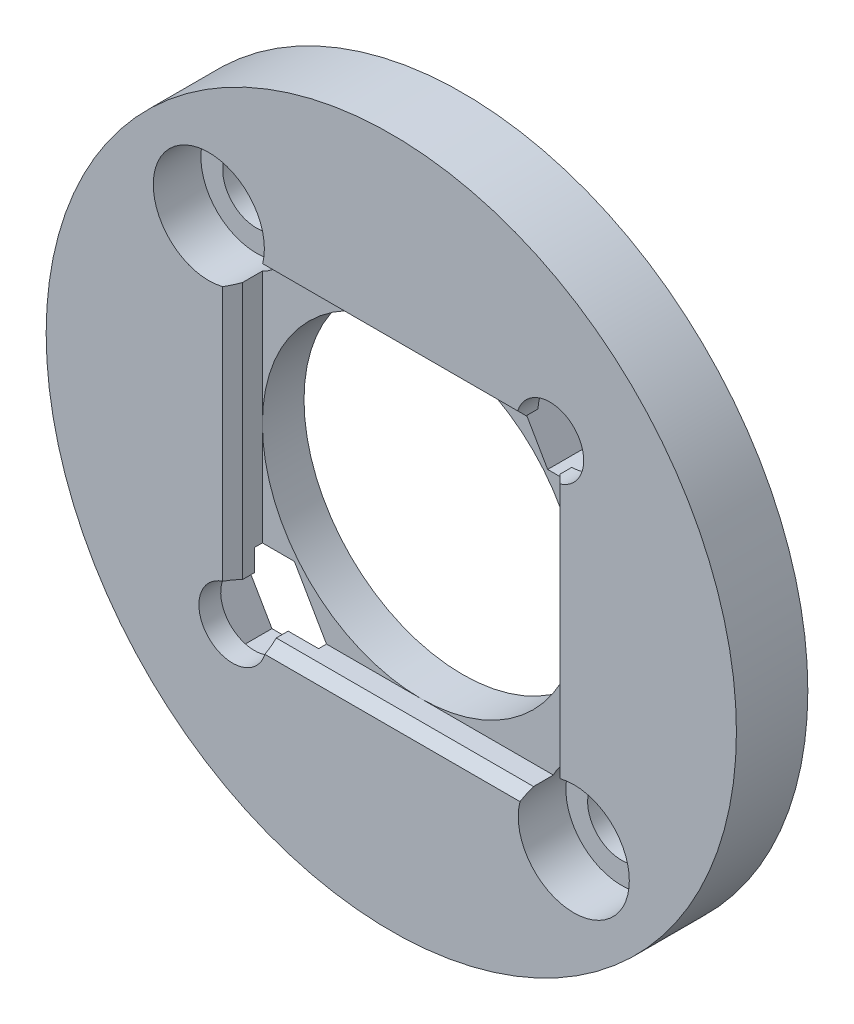
ISO-10303-21;
HEADER;
FILE_DESCRIPTION(('STEP AP214'),'2;1');
FILE_NAME('part.step','',(''),(''),'','','');
FILE_SCHEMA(('AUTOMOTIVE_DESIGN { 1 0 10303 214 1 1 1 1 }'));
ENDSEC;
DATA;
#1=APPLICATION_CONTEXT('core data for automotive mechanical design processes');
#2=APPLICATION_PROTOCOL_DEFINITION('international standard','automotive_design',2000,#1);
#3=PRODUCT_CONTEXT('',#1,'mechanical');
#4=PRODUCT('Part','Part','',(#3));
#5=PRODUCT_RELATED_PRODUCT_CATEGORY('part','',(#4));
#6=PRODUCT_DEFINITION_FORMATION('','',#4);
#7=PRODUCT_DEFINITION_CONTEXT('part definition',#1,'design');
#8=PRODUCT_DEFINITION('design','',#6,#7);
#9=PRODUCT_DEFINITION_SHAPE('','',#8);
#10=(LENGTH_UNIT() NAMED_UNIT(*) SI_UNIT(.MILLI.,.METRE.));
#11=(NAMED_UNIT(*) PLANE_ANGLE_UNIT() SI_UNIT($,.RADIAN.));
#12=(NAMED_UNIT(*) SI_UNIT($,.STERADIAN.) SOLID_ANGLE_UNIT());
#13=UNCERTAINTY_MEASURE_WITH_UNIT(LENGTH_MEASURE(1.E-05),#10,'distance_accuracy_value','');
#14=(GEOMETRIC_REPRESENTATION_CONTEXT(3) GLOBAL_UNCERTAINTY_ASSIGNED_CONTEXT((#13)) GLOBAL_UNIT_ASSIGNED_CONTEXT((#10,
#11,#12)) REPRESENTATION_CONTEXT('',''));
#15=CARTESIAN_POINT('',(0.,0.,0.));
#16=DIRECTION('',(0.,0.,1.));
#17=DIRECTION('',(1.,0.,0.));
#18=AXIS2_PLACEMENT_3D('',#15,#16,#17);
#19=CARTESIAN_POINT('',(8.,8.,0.));
#20=DIRECTION('',(0.,0.,1.));
#21=DIRECTION('',(1.,0.,0.));
#22=AXIS2_PLACEMENT_3D('',#19,#20,#21);
#23=CYLINDRICAL_SURFACE('',#22,1.7);
#24=DIRECTION('',(0.,0.,1.));
#25=VECTOR('',#24,1.);
#26=CARTESIAN_POINT('',(8.,6.3,0.));
#27=LINE('',#26,#25);
#28=CARTESIAN_POINT('',(8.,6.3,2.5));
#29=VERTEX_POINT('',#28);
#30=CARTESIAN_POINT('',(8.,6.3,3.10000000000001));
#31=VERTEX_POINT('',#30);
#32=EDGE_CURVE('E283',#29,#31,#27,.T.);
#33=ORIENTED_EDGE('',*,*,#32,.T.);
#34=CARTESIAN_POINT('',(8.,8.,3.10000000000001));
#35=DIRECTION('',(-0.707106781186543,0.,0.707106781186552));
#36=DIRECTION('',(0.707106781186552,0.,0.707106781186543));
#37=AXIS2_PLACEMENT_3D('',#34,#35,#36);
#38=ELLIPSE('',#37,2.40416305603424,1.7);
#39=CARTESIAN_POINT('',(8.5,6.37519231907281,3.6));
#40=VERTEX_POINT('',#39);
#41=EDGE_CURVE('E51',#31,#40,#38,.T.);
#42=ORIENTED_EDGE('',*,*,#41,.T.);
#43=CARTESIAN_POINT('',(8.,8.,3.6));
#44=DIRECTION('',(0.,0.,1.));
#45=DIRECTION('',(1.,0.,0.));
#46=AXIS2_PLACEMENT_3D('',#43,#44,#45);
#47=CIRCLE('',#46,1.7);
#48=CARTESIAN_POINT('',(6.3751923190728,8.5,3.6));
#49=VERTEX_POINT('',#48);
#50=EDGE_CURVE('E445',#40,#49,#47,.T.);
#51=ORIENTED_EDGE('',*,*,#50,.T.);
#52=CARTESIAN_POINT('',(8.,8.,3.10000000000001));
#53=DIRECTION('',(0.,-0.707106781186543,0.707106781186552));
#54=DIRECTION('',(0.,0.707106781186552,0.707106781186543));
#55=AXIS2_PLACEMENT_3D('',#52,#53,#54);
#56=ELLIPSE('',#55,2.40416305603424,1.7);
#57=CARTESIAN_POINT('',(6.3,8.,3.10000000000001));
#58=VERTEX_POINT('',#57);
#59=EDGE_CURVE('E58',#49,#58,#56,.T.);
#60=ORIENTED_EDGE('',*,*,#59,.T.);
#61=DIRECTION('',(0.,0.,1.));
#62=VECTOR('',#61,1.);
#63=CARTESIAN_POINT('',(6.3,8.,0.));
#64=LINE('',#63,#62);
#65=CARTESIAN_POINT('',(6.3,8.,2.5));
#66=VERTEX_POINT('',#65);
#67=EDGE_CURVE('E592',#58,#66,#64,.F.);
#68=ORIENTED_EDGE('',*,*,#67,.T.);
#69=CARTESIAN_POINT('',(8.,8.,2.5));
#70=DIRECTION('',(0.,0.,-1.));
#71=DIRECTION('',(-1.,0.,0.));
#72=AXIS2_PLACEMENT_3D('',#69,#70,#71);
#73=CIRCLE('',#72,1.7);
#74=EDGE_CURVE('E448',#29,#66,#73,.F.);
#75=ORIENTED_EDGE('',*,*,#74,.F.);
#76=EDGE_LOOP('',(#33,#42,#51,#60,#68,#75));
#77=FACE_BOUND('',#76,.T.);
#78=ADVANCED_FACE('F41',(#77),#23,.F.);
#79=CARTESIAN_POINT('',(-8.,-8.,0.));
#80=DIRECTION('',(0.,0.,1.));
#81=DIRECTION('',(1.,0.,0.));
#82=AXIS2_PLACEMENT_3D('',#79,#80,#81);
#83=CYLINDRICAL_SURFACE('',#82,1.7);
#84=DIRECTION('',(0.,0.,1.));
#85=VECTOR('',#84,1.);
#86=CARTESIAN_POINT('',(-8.,-6.3,0.));
#87=LINE('',#86,#85);
#88=CARTESIAN_POINT('',(-8.,-6.3,2.5));
#89=VERTEX_POINT('',#88);
#90=CARTESIAN_POINT('',(-8.,-6.3,3.10000000000001));
#91=VERTEX_POINT('',#90);
#92=EDGE_CURVE('E304',#89,#91,#87,.T.);
#93=ORIENTED_EDGE('',*,*,#92,.T.);
#94=CARTESIAN_POINT('',(-8.,-8.,3.10000000000001));
#95=DIRECTION('',(0.707106781186543,0.,0.707106781186552));
#96=DIRECTION('',(-0.707106781186552,0.,0.707106781186543));
#97=AXIS2_PLACEMENT_3D('',#94,#95,#96);
#98=ELLIPSE('',#97,2.40416305603425,1.7);
#99=CARTESIAN_POINT('',(-8.5,-6.37519231907281,3.6));
#100=VERTEX_POINT('',#99);
#101=EDGE_CURVE('E517',#91,#100,#98,.T.);
#102=ORIENTED_EDGE('',*,*,#101,.T.);
#103=CARTESIAN_POINT('',(-8.,-8.,3.6));
#104=DIRECTION('',(0.,0.,1.));
#105=DIRECTION('',(1.,0.,0.));
#106=AXIS2_PLACEMENT_3D('',#103,#104,#105);
#107=CIRCLE('',#106,1.7);
#108=CARTESIAN_POINT('',(-6.37519231907281,-8.5,3.6));
#109=VERTEX_POINT('',#108);
#110=EDGE_CURVE('E440',#100,#109,#107,.T.);
#111=ORIENTED_EDGE('',*,*,#110,.T.);
#112=CARTESIAN_POINT('',(-8.,-8.,3.10000000000001));
#113=DIRECTION('',(0.,0.707106781186543,0.707106781186552));
#114=DIRECTION('',(0.,-0.707106781186552,0.707106781186543));
#115=AXIS2_PLACEMENT_3D('',#112,#113,#114);
#116=ELLIPSE('',#115,2.40416305603425,1.7);
#117=CARTESIAN_POINT('',(-6.3,-8.,3.10000000000001));
#118=VERTEX_POINT('',#117);
#119=EDGE_CURVE('E514',#109,#118,#116,.T.);
#120=ORIENTED_EDGE('',*,*,#119,.T.);
#121=DIRECTION('',(0.,0.,1.));
#122=VECTOR('',#121,1.);
#123=CARTESIAN_POINT('',(-6.3,-8.,0.));
#124=LINE('',#123,#122);
#125=CARTESIAN_POINT('',(-6.3,-8.,2.5));
#126=VERTEX_POINT('',#125);
#127=EDGE_CURVE('E294',#118,#126,#124,.F.);
#128=ORIENTED_EDGE('',*,*,#127,.T.);
#129=CARTESIAN_POINT('',(-8.,-8.,2.5));
#130=DIRECTION('',(0.,0.,-1.));
#131=DIRECTION('',(-1.,0.,0.));
#132=AXIS2_PLACEMENT_3D('',#129,#130,#131);
#133=CIRCLE('',#132,1.7);
#134=EDGE_CURVE('E361',#89,#126,#133,.F.);
#135=ORIENTED_EDGE('',*,*,#134,.F.);
#136=EDGE_LOOP('',(#93,#102,#111,#120,#128,#135));
#137=FACE_BOUND('',#136,.T.);
#138=ADVANCED_FACE('F661',(#137),#83,.F.);
#139=CARTESIAN_POINT('',(9.19999999999999,-9.19999999999923,0.));
#140=DIRECTION('',(0.,0.,1.));
#141=DIRECTION('',(1.,0.,0.));
#142=AXIS2_PLACEMENT_3D('',#139,#140,#141);
#143=CYLINDRICAL_SURFACE('',#142,1.7);
#144=CARTESIAN_POINT('',(9.19999999999999,-9.19999999999923,0.));
#145=DIRECTION('',(0.,0.,1.));
#146=DIRECTION('',(1.,0.,0.));
#147=AXIS2_PLACEMENT_3D('',#144,#145,#146);
#148=CIRCLE('',#147,1.7);
#149=CARTESIAN_POINT('',(10.9,-9.19999999999923,0.));
#150=VERTEX_POINT('',#149);
#151=EDGE_CURVE('E469',#150,#150,#148,.T.);
#152=ORIENTED_EDGE('',*,*,#151,.F.);
#153=EDGE_LOOP('',(#152));
#154=FACE_BOUND('',#153,.T.);
#155=CARTESIAN_POINT('',(9.19999999999999,-9.19999999999923,1.2));
#156=DIRECTION('',(0.,0.,1.));
#157=DIRECTION('',(1.,0.,0.));
#158=AXIS2_PLACEMENT_3D('',#155,#156,#157);
#159=CIRCLE('',#158,1.7);
#160=CARTESIAN_POINT('',(10.9,-9.19999999999923,1.2));
#161=VERTEX_POINT('',#160);
#162=EDGE_CURVE('E470',#161,#161,#159,.F.);
#163=ORIENTED_EDGE('',*,*,#162,.F.);
#164=EDGE_LOOP('',(#163));
#165=FACE_BOUND('',#164,.T.);
#166=ADVANCED_FACE('F696',(#154,#165),#143,.F.);
#167=CARTESIAN_POINT('',(-9.2,9.2,0.));
#168=DIRECTION('',(0.,0.,1.));
#169=DIRECTION('',(1.,0.,0.));
#170=AXIS2_PLACEMENT_3D('',#167,#168,#169);
#171=CYLINDRICAL_SURFACE('',#170,1.7);
#172=CARTESIAN_POINT('',(-9.2,9.2,0.));
#173=DIRECTION('',(0.,0.,1.));
#174=DIRECTION('',(1.,0.,0.));
#175=AXIS2_PLACEMENT_3D('',#172,#173,#174);
#176=CIRCLE('',#175,1.7);
#177=CARTESIAN_POINT('',(-7.5,9.2,0.));
#178=VERTEX_POINT('',#177);
#179=EDGE_CURVE('E471',#178,#178,#176,.T.);
#180=ORIENTED_EDGE('',*,*,#179,.F.);
#181=EDGE_LOOP('',(#180));
#182=FACE_BOUND('',#181,.T.);
#183=CARTESIAN_POINT('',(-9.2,9.2,1.2));
#184=DIRECTION('',(0.,0.,1.));
#185=DIRECTION('',(1.,0.,0.));
#186=AXIS2_PLACEMENT_3D('',#183,#184,#185);
#187=CIRCLE('',#186,1.7);
#188=CARTESIAN_POINT('',(-7.5,9.2,1.2));
#189=VERTEX_POINT('',#188);
#190=EDGE_CURVE('E453',#189,#189,#187,.F.);
#191=ORIENTED_EDGE('',*,*,#190,.F.);
#192=EDGE_LOOP('',(#191));
#193=FACE_BOUND('',#192,.T.);
#194=ADVANCED_FACE('F714',(#182,#193),#171,.F.);
#195=CARTESIAN_POINT('',(0.,0.,3.6));
#196=DIRECTION('',(0.,0.,-1.));
#197=DIRECTION('',(-1.,0.,0.));
#198=AXIS2_PLACEMENT_3D('',#195,#196,#197);
#199=CYLINDRICAL_SURFACE('',#198,17.4);
#200=CARTESIAN_POINT('',(0.,0.,3.6));
#201=DIRECTION('',(0.,0.,1.));
#202=DIRECTION('',(1.,0.,0.));
#203=AXIS2_PLACEMENT_3D('',#200,#201,#202);
#204=CIRCLE('',#203,17.4);
#205=CARTESIAN_POINT('',(17.4,0.,3.6));
#206=VERTEX_POINT('',#205);
#207=EDGE_CURVE('E479',#206,#206,#204,.T.);
#208=ORIENTED_EDGE('',*,*,#207,.F.);
#209=EDGE_LOOP('',(#208));
#210=FACE_BOUND('',#209,.T.);
#211=CARTESIAN_POINT('',(0.,0.,0.));
#212=DIRECTION('',(0.,0.,1.));
#213=DIRECTION('',(1.,0.,0.));
#214=AXIS2_PLACEMENT_3D('',#211,#212,#213);
#215=CIRCLE('',#214,17.4);
#216=CARTESIAN_POINT('',(17.4,0.,0.));
#217=VERTEX_POINT('',#216);
#218=EDGE_CURVE('E475',#217,#217,#215,.T.);
#219=ORIENTED_EDGE('',*,*,#218,.T.);
#220=EDGE_LOOP('',(#219));
#221=FACE_BOUND('',#220,.T.);
#222=ADVANCED_FACE('F717',(#210,#221),#199,.T.);
#223=CARTESIAN_POINT('',(0.,0.,3.6));
#224=DIRECTION('',(0.,0.,1.));
#225=DIRECTION('',(1.,0.,0.));
#226=AXIS2_PLACEMENT_3D('',#223,#224,#225);
#227=PLANE('',#226);
#228=ORIENTED_EDGE('',*,*,#110,.F.);
#229=DIRECTION('',(0.,1.,0.));
#230=VECTOR('',#229,1.);
#231=CARTESIAN_POINT('',(-8.5,6.6701778718653,3.6));
#232=LINE('',#231,#230);
#233=CARTESIAN_POINT('',(-8.5,6.48891165765481,3.6));
#234=VERTEX_POINT('',#233);
#235=EDGE_CURVE('E529',#100,#234,#232,.T.);
#236=ORIENTED_EDGE('',*,*,#235,.T.);
#237=CARTESIAN_POINT('',(-9.2,9.2,3.6));
#238=DIRECTION('',(0.,0.,1.));
#239=DIRECTION('',(1.,0.,0.));
#240=AXIS2_PLACEMENT_3D('',#237,#238,#239);
#241=CIRCLE('',#240,2.8);
#242=CARTESIAN_POINT('',(-6.48891165765481,8.5,3.6));
#243=VERTEX_POINT('',#242);
#244=EDGE_CURVE('E454',#243,#234,#241,.T.);
#245=ORIENTED_EDGE('',*,*,#244,.F.);
#246=DIRECTION('',(1.,0.,0.));
#247=VECTOR('',#246,1.);
#248=CARTESIAN_POINT('',(6.3,8.5,3.6));
#249=LINE('',#248,#247);
#250=EDGE_CURVE('E520',#243,#49,#249,.T.);
#251=ORIENTED_EDGE('',*,*,#250,.T.);
#252=ORIENTED_EDGE('',*,*,#50,.F.);
#253=DIRECTION('',(0.,-1.,0.));
#254=VECTOR('',#253,1.);
#255=CARTESIAN_POINT('',(8.5,-6.67017787186452,3.6));
#256=LINE('',#255,#254);
#257=CARTESIAN_POINT('',(8.5,-6.48891165765404,3.6));
#258=VERTEX_POINT('',#257);
#259=EDGE_CURVE('E523',#40,#258,#256,.T.);
#260=ORIENTED_EDGE('',*,*,#259,.T.);
#261=CARTESIAN_POINT('',(9.19999999999999,-9.19999999999923,3.6));
#262=DIRECTION('',(0.,0.,1.));
#263=DIRECTION('',(1.,0.,0.));
#264=AXIS2_PLACEMENT_3D('',#261,#262,#263);
#265=CIRCLE('',#264,2.8);
#266=CARTESIAN_POINT('',(6.4889116576546,-8.5,3.6));
#267=VERTEX_POINT('',#266);
#268=EDGE_CURVE('E444',#267,#258,#265,.T.);
#269=ORIENTED_EDGE('',*,*,#268,.F.);
#270=DIRECTION('',(-1.,0.,0.));
#271=VECTOR('',#270,1.);
#272=CARTESIAN_POINT('',(-6.3,-8.5,3.6));
#273=LINE('',#272,#271);
#274=EDGE_CURVE('E526',#267,#109,#273,.T.);
#275=ORIENTED_EDGE('',*,*,#274,.T.);
#276=EDGE_LOOP('',(#228,#236,#245,#251,#252,#260,#269,#275));
#277=FACE_BOUND('',#276,.T.);
#278=ORIENTED_EDGE('',*,*,#207,.T.);
#279=EDGE_LOOP('',(#278));
#280=FACE_BOUND('',#279,.T.);
#281=ADVANCED_FACE('F557',(#277,#280),#227,.T.);
#282=CARTESIAN_POINT('',(0.,0.,0.));
#283=DIRECTION('',(0.,0.,1.));
#284=DIRECTION('',(1.,0.,0.));
#285=AXIS2_PLACEMENT_3D('',#282,#283,#284);
#286=PLANE('',#285);
#287=DIRECTION('',(0.5,0.866025403784439,0.));
#288=VECTOR('',#287,1.);
#289=CARTESIAN_POINT('',(4.76683849253809,8.,0.));
#290=LINE('',#289,#288);
#291=CARTESIAN_POINT('',(4.76683849253809,8.,0.));
#292=VERTEX_POINT('',#291);
#293=CARTESIAN_POINT('',(6.38341924626904,10.8,0.));
#294=VERTEX_POINT('',#293);
#295=EDGE_CURVE('E338',#292,#294,#290,.T.);
#296=ORIENTED_EDGE('',*,*,#295,.F.);
#297=DIRECTION('',(-0.5,0.866025403784439,0.));
#298=VECTOR('',#297,1.);
#299=CARTESIAN_POINT('',(6.38341924626904,5.2,0.));
#300=LINE('',#299,#298);
#301=CARTESIAN_POINT('',(6.38341924626904,5.2,0.));
#302=VERTEX_POINT('',#301);
#303=EDGE_CURVE('E334',#302,#292,#300,.T.);
#304=ORIENTED_EDGE('',*,*,#303,.F.);
#305=DIRECTION('',(-1.,0.,0.));
#306=VECTOR('',#305,1.);
#307=CARTESIAN_POINT('',(9.61658075373095,5.2,0.));
#308=LINE('',#307,#306);
#309=CARTESIAN_POINT('',(9.61658075373095,5.2,0.));
#310=VERTEX_POINT('',#309);
#311=EDGE_CURVE('E317',#310,#302,#308,.T.);
#312=ORIENTED_EDGE('',*,*,#311,.F.);
#313=DIRECTION('',(-0.5,-0.866025403784438,0.));
#314=VECTOR('',#313,1.);
#315=CARTESIAN_POINT('',(11.2331615074619,7.99999999999999,0.));
#316=LINE('',#315,#314);
#317=CARTESIAN_POINT('',(11.2331615074619,7.99999999999999,0.));
#318=VERTEX_POINT('',#317);
#319=EDGE_CURVE('E351',#318,#310,#316,.T.);
#320=ORIENTED_EDGE('',*,*,#319,.F.);
#321=DIRECTION('',(0.5,-0.866025403784439,0.));
#322=VECTOR('',#321,1.);
#323=CARTESIAN_POINT('',(9.61658075373095,10.8,0.));
#324=LINE('',#323,#322);
#325=CARTESIAN_POINT('',(9.61658075373095,10.8,0.));
#326=VERTEX_POINT('',#325);
#327=EDGE_CURVE('E347',#326,#318,#324,.T.);
#328=ORIENTED_EDGE('',*,*,#327,.F.);
#329=DIRECTION('',(1.,0.,0.));
#330=VECTOR('',#329,1.);
#331=CARTESIAN_POINT('',(6.38341924626904,10.8,0.));
#332=LINE('',#331,#330);
#333=EDGE_CURVE('E343',#294,#326,#332,.T.);
#334=ORIENTED_EDGE('',*,*,#333,.F.);
#335=EDGE_LOOP('',(#296,#304,#312,#320,#328,#334));
#336=FACE_BOUND('',#335,.T.);
#337=DIRECTION('',(-0.499999999999913,-0.866025403784489,0.));
#338=VECTOR('',#337,1.);
#339=CARTESIAN_POINT('',(-4.76683849253787,-7.99999999999976,0.));
#340=LINE('',#339,#338);
#341=CARTESIAN_POINT('',(-4.76683849253787,-7.99999999999976,0.));
#342=VERTEX_POINT('',#341);
#343=CARTESIAN_POINT('',(-6.38341924626854,-10.7999999999999,0.));
#344=VERTEX_POINT('',#343);
#345=EDGE_CURVE('E403',#342,#344,#340,.T.);
#346=ORIENTED_EDGE('',*,*,#345,.F.);
#347=DIRECTION('',(0.50000000000008,-0.866025403784392,0.));
#348=VECTOR('',#347,1.);
#349=CARTESIAN_POINT('',(-6.38341924626901,-5.20000000000004,0.));
#350=LINE('',#349,#348);
#351=CARTESIAN_POINT('',(-6.38341924626901,-5.20000000000004,0.));
#352=VERTEX_POINT('',#351);
#353=EDGE_CURVE('E311',#352,#342,#350,.T.);
#354=ORIENTED_EDGE('',*,*,#353,.F.);
#355=DIRECTION('',(1.,0.,0.));
#356=VECTOR('',#355,1.);
#357=CARTESIAN_POINT('',(-9.61658075373091,-5.20000000000006,0.));
#358=LINE('',#357,#356);
#359=CARTESIAN_POINT('',(-9.61658075373091,-5.20000000000006,0.));
#360=VERTEX_POINT('',#359);
#361=EDGE_CURVE('E383',#360,#352,#358,.T.);
#362=ORIENTED_EDGE('',*,*,#361,.F.);
#363=DIRECTION('',(0.499999999999911,0.86602540378449,0.));
#364=VECTOR('',#363,1.);
#365=CARTESIAN_POINT('',(-11.2331615074617,-8.00000000000041,0.));
#366=LINE('',#365,#364);
#367=CARTESIAN_POINT('',(-11.2331615074617,-8.00000000000041,0.));
#368=VERTEX_POINT('',#367);
#369=EDGE_CURVE('E415',#368,#360,#366,.T.);
#370=ORIENTED_EDGE('',*,*,#369,.F.);
#371=DIRECTION('',(-0.500000000000087,0.866025403784388,0.));
#372=VECTOR('',#371,1.);
#373=CARTESIAN_POINT('',(-9.61658075373045,-10.8000000000003,0.));
#374=LINE('',#373,#372);
#375=CARTESIAN_POINT('',(-9.61658075373045,-10.8000000000003,0.));
#376=VERTEX_POINT('',#375);
#377=EDGE_CURVE('E411',#376,#368,#374,.T.);
#378=ORIENTED_EDGE('',*,*,#377,.F.);
#379=DIRECTION('',(-1.,-1.01406235414758E-13,0.));
#380=VECTOR('',#379,1.);
#381=CARTESIAN_POINT('',(-6.38341924626854,-10.7999999999999,0.));
#382=LINE('',#381,#380);
#383=EDGE_CURVE('E407',#344,#376,#382,.T.);
#384=ORIENTED_EDGE('',*,*,#383,.F.);
#385=EDGE_LOOP('',(#346,#354,#362,#370,#378,#384));
#386=FACE_BOUND('',#385,.T.);
#387=CARTESIAN_POINT('',(0.,0.,0.));
#388=DIRECTION('',(0.,0.,1.));
#389=DIRECTION('',(1.,0.,0.));
#390=AXIS2_PLACEMENT_3D('',#387,#388,#389);
#391=CIRCLE('',#390,8.);
#392=CARTESIAN_POINT('',(8.,0.,0.));
#393=VERTEX_POINT('',#392);
#394=EDGE_CURVE('E465',#393,#393,#391,.T.);
#395=ORIENTED_EDGE('',*,*,#394,.T.);
#396=EDGE_LOOP('',(#395));
#397=FACE_BOUND('',#396,.T.);
#398=ORIENTED_EDGE('',*,*,#179,.T.);
#399=EDGE_LOOP('',(#398));
#400=FACE_BOUND('',#399,.T.);
#401=ORIENTED_EDGE('',*,*,#151,.T.);
#402=EDGE_LOOP('',(#401));
#403=FACE_BOUND('',#402,.T.);
#404=ORIENTED_EDGE('',*,*,#218,.F.);
#405=EDGE_LOOP('',(#404));
#406=FACE_BOUND('',#405,.T.);
#407=ADVANCED_FACE('F640',(#336,#386,#397,#400,#403,#406),#286,.F.);
#408=CARTESIAN_POINT('',(0.,0.,0.));
#409=DIRECTION('',(0.,0.,1.));
#410=DIRECTION('',(1.,0.,0.));
#411=AXIS2_PLACEMENT_3D('',#408,#409,#410);
#412=CYLINDRICAL_SURFACE('',#411,8.);
#413=CARTESIAN_POINT('',(0.,0.,2.1));
#414=DIRECTION('',(0.,0.,-1.));
#415=DIRECTION('',(-1.,0.,0.));
#416=AXIS2_PLACEMENT_3D('',#413,#414,#415);
#417=CIRCLE('',#416,8.);
#418=CARTESIAN_POINT('',(0.,8.,2.1));
#419=VERTEX_POINT('',#418);
#420=CARTESIAN_POINT('',(-8.,0.,2.1));
#421=VERTEX_POINT('',#420);
#422=EDGE_CURVE('E235',#419,#421,#417,.F.);
#423=ORIENTED_EDGE('',*,*,#422,.T.);
#424=CARTESIAN_POINT('',(0.,-8.,2.1));
#425=VERTEX_POINT('',#424);
#426=EDGE_CURVE('E251',#421,#425,#417,.F.);
#427=ORIENTED_EDGE('',*,*,#426,.T.);
#428=CARTESIAN_POINT('',(8.,0.,2.1));
#429=VERTEX_POINT('',#428);
#430=EDGE_CURVE('E274',#425,#429,#417,.F.);
#431=ORIENTED_EDGE('',*,*,#430,.T.);
#432=EDGE_CURVE('E248',#429,#419,#417,.F.);
#433=ORIENTED_EDGE('',*,*,#432,.T.);
#434=EDGE_LOOP('',(#423,#427,#431,#433));
#435=FACE_BOUND('',#434,.T.);
#436=ORIENTED_EDGE('',*,*,#394,.F.);
#437=EDGE_LOOP('',(#436));
#438=FACE_BOUND('',#437,.T.);
#439=ADVANCED_FACE('F272',(#435,#438),#412,.F.);
#440=CARTESIAN_POINT('',(-9.2,9.2,1.2));
#441=DIRECTION('',(0.,0.,1.));
#442=DIRECTION('',(1.,0.,0.));
#443=AXIS2_PLACEMENT_3D('',#440,#441,#442);
#444=PLANE('',#443);
#445=CARTESIAN_POINT('',(-9.2,9.2,1.2));
#446=DIRECTION('',(0.,0.,1.));
#447=DIRECTION('',(1.,0.,0.));
#448=AXIS2_PLACEMENT_3D('',#445,#446,#447);
#449=CIRCLE('',#448,2.8);
#450=CARTESIAN_POINT('',(-6.4,9.2,1.2));
#451=VERTEX_POINT('',#450);
#452=EDGE_CURVE('E449',#451,#451,#449,.T.);
#453=ORIENTED_EDGE('',*,*,#452,.T.);
#454=EDGE_LOOP('',(#453));
#455=FACE_BOUND('',#454,.T.);
#456=ORIENTED_EDGE('',*,*,#190,.T.);
#457=EDGE_LOOP('',(#456));
#458=FACE_BOUND('',#457,.T.);
#459=ADVANCED_FACE('F700',(#455,#458),#444,.T.);
#460=CARTESIAN_POINT('',(-9.2,9.2,1.2));
#461=DIRECTION('',(0.,0.,1.));
#462=DIRECTION('',(1.,0.,0.));
#463=AXIS2_PLACEMENT_3D('',#460,#461,#462);
#464=CYLINDRICAL_SURFACE('',#463,2.8);
#465=ORIENTED_EDGE('',*,*,#244,.T.);
#466=CARTESIAN_POINT('',(-9.2,9.2,4.29999999999999));
#467=DIRECTION('',(0.707106781186543,0.,0.707106781186552));
#468=DIRECTION('',(-0.707106781186552,0.,0.707106781186543));
#469=AXIS2_PLACEMENT_3D('',#466,#467,#468);
#470=ELLIPSE('',#469,3.95979797464464,2.8);
#471=CARTESIAN_POINT('',(-8.,6.6701778718653,3.10000000000001));
#472=VERTEX_POINT('',#471);
#473=EDGE_CURVE('E535',#234,#472,#470,.T.);
#474=ORIENTED_EDGE('',*,*,#473,.T.);
#475=DIRECTION('',(0.,0.,1.));
#476=VECTOR('',#475,1.);
#477=CARTESIAN_POINT('',(-8.,6.6701778718653,1.2));
#478=LINE('',#477,#476);
#479=CARTESIAN_POINT('',(-8.,6.6701778718653,2.1));
#480=VERTEX_POINT('',#479);
#481=EDGE_CURVE('E308',#472,#480,#478,.F.);
#482=ORIENTED_EDGE('',*,*,#481,.T.);
#483=CARTESIAN_POINT('',(-9.2,9.2,2.1));
#484=DIRECTION('',(0.,0.,-1.));
#485=DIRECTION('',(-1.,0.,0.));
#486=AXIS2_PLACEMENT_3D('',#483,#484,#485);
#487=CIRCLE('',#486,2.8);
#488=CARTESIAN_POINT('',(-6.6701778718653,8.,2.1));
#489=VERTEX_POINT('',#488);
#490=EDGE_CURVE('E249',#480,#489,#487,.F.);
#491=ORIENTED_EDGE('',*,*,#490,.T.);
#492=DIRECTION('',(0.,0.,1.));
#493=VECTOR('',#492,1.);
#494=CARTESIAN_POINT('',(-6.6701778718653,8.,1.2));
#495=LINE('',#494,#493);
#496=CARTESIAN_POINT('',(-6.6701778718653,8.,3.10000000000001));
#497=VERTEX_POINT('',#496);
#498=EDGE_CURVE('E258',#489,#497,#495,.T.);
#499=ORIENTED_EDGE('',*,*,#498,.T.);
#500=CARTESIAN_POINT('',(-9.2,9.2,4.29999999999999));
#501=DIRECTION('',(0.,-0.707106781186543,0.707106781186552));
#502=DIRECTION('',(0.,0.707106781186552,0.707106781186543));
#503=AXIS2_PLACEMENT_3D('',#500,#501,#502);
#504=ELLIPSE('',#503,3.95979797464464,2.8);
#505=EDGE_CURVE('E532',#497,#243,#504,.T.);
#506=ORIENTED_EDGE('',*,*,#505,.T.);
#507=EDGE_LOOP('',(#465,#474,#482,#491,#499,#506));
#508=FACE_BOUND('',#507,.T.);
#509=ORIENTED_EDGE('',*,*,#452,.F.);
#510=EDGE_LOOP('',(#509));
#511=FACE_BOUND('',#510,.T.);
#512=ADVANCED_FACE('F610',(#508,#511),#464,.F.);
#513=CARTESIAN_POINT('',(9.19999999999999,-9.19999999999923,1.2));
#514=DIRECTION('',(0.,0.,1.));
#515=DIRECTION('',(1.,0.,0.));
#516=AXIS2_PLACEMENT_3D('',#513,#514,#515);
#517=PLANE('',#516);
#518=CARTESIAN_POINT('',(9.19999999999999,-9.19999999999923,1.2));
#519=DIRECTION('',(0.,0.,1.));
#520=DIRECTION('',(1.,0.,0.));
#521=AXIS2_PLACEMENT_3D('',#518,#519,#520);
#522=CIRCLE('',#521,2.8);
#523=CARTESIAN_POINT('',(12.,-9.19999999999923,1.2));
#524=VERTEX_POINT('',#523);
#525=EDGE_CURVE('E458',#524,#524,#522,.T.);
#526=ORIENTED_EDGE('',*,*,#525,.T.);
#527=EDGE_LOOP('',(#526));
#528=FACE_BOUND('',#527,.T.);
#529=ORIENTED_EDGE('',*,*,#162,.T.);
#530=EDGE_LOOP('',(#529));
#531=FACE_BOUND('',#530,.T.);
#532=ADVANCED_FACE('F706',(#528,#531),#517,.T.);
#533=CARTESIAN_POINT('',(9.19999999999999,-9.19999999999923,1.2));
#534=DIRECTION('',(0.,0.,1.));
#535=DIRECTION('',(1.,0.,0.));
#536=AXIS2_PLACEMENT_3D('',#533,#534,#535);
#537=CYLINDRICAL_SURFACE('',#536,2.8);
#538=DIRECTION('',(0.,0.,1.));
#539=VECTOR('',#538,1.);
#540=CARTESIAN_POINT('',(6.67017787186492,-8.,1.2));
#541=LINE('',#540,#539);
#542=CARTESIAN_POINT('',(6.67017787186492,-8.,2.1));
#543=VERTEX_POINT('',#542);
#544=CARTESIAN_POINT('',(6.67017787186492,-8.,3.10000000000001));
#545=VERTEX_POINT('',#544);
#546=EDGE_CURVE('E297',#543,#545,#541,.T.);
#547=ORIENTED_EDGE('',*,*,#546,.T.);
#548=CARTESIAN_POINT('',(9.19999999999999,-9.19999999999923,4.29999999999922));
#549=DIRECTION('',(0.,0.707106781186543,0.707106781186552));
#550=DIRECTION('',(0.,-0.707106781186552,0.707106781186543));
#551=AXIS2_PLACEMENT_3D('',#548,#549,#550);
#552=ELLIPSE('',#551,3.95979797464464,2.8);
#553=EDGE_CURVE('E545',#545,#267,#552,.T.);
#554=ORIENTED_EDGE('',*,*,#553,.T.);
#555=ORIENTED_EDGE('',*,*,#268,.T.);
#556=CARTESIAN_POINT('',(9.19999999999999,-9.19999999999923,4.29999999999999));
#557=DIRECTION('',(-0.707106781186543,0.,0.707106781186552));
#558=DIRECTION('',(0.707106781186552,0.,0.707106781186543));
#559=AXIS2_PLACEMENT_3D('',#556,#557,#558);
#560=ELLIPSE('',#559,3.95979797464464,2.8);
#561=CARTESIAN_POINT('',(8.,-6.67017787186452,3.10000000000001));
#562=VERTEX_POINT('',#561);
#563=EDGE_CURVE('E542',#258,#562,#560,.T.);
#564=ORIENTED_EDGE('',*,*,#563,.T.);
#565=DIRECTION('',(0.,0.,1.));
#566=VECTOR('',#565,1.);
#567=CARTESIAN_POINT('',(8.,-6.67017787186452,1.2));
#568=LINE('',#567,#566);
#569=CARTESIAN_POINT('',(8.,-6.67017787186452,2.1));
#570=VERTEX_POINT('',#569);
#571=EDGE_CURVE('E287',#562,#570,#568,.F.);
#572=ORIENTED_EDGE('',*,*,#571,.T.);
#573=CARTESIAN_POINT('',(9.19999999999999,-9.19999999999923,2.1));
#574=DIRECTION('',(0.,0.,-1.));
#575=DIRECTION('',(-1.,0.,0.));
#576=AXIS2_PLACEMENT_3D('',#573,#574,#575);
#577=CIRCLE('',#576,2.8);
#578=EDGE_CURVE('E606',#570,#543,#577,.F.);
#579=ORIENTED_EDGE('',*,*,#578,.T.);
#580=EDGE_LOOP('',(#547,#554,#555,#564,#572,#579));
#581=FACE_BOUND('',#580,.T.);
#582=ORIENTED_EDGE('',*,*,#525,.F.);
#583=EDGE_LOOP('',(#582));
#584=FACE_BOUND('',#583,.T.);
#585=ADVANCED_FACE('F566',(#581,#584),#537,.F.);
#586=CARTESIAN_POINT('',(0.,0.,2.5));
#587=DIRECTION('',(0.,0.,-1.));
#588=DIRECTION('',(-1.,0.,0.));
#589=AXIS2_PLACEMENT_3D('',#586,#587,#588);
#590=PLANE('',#589);
#591=DIRECTION('',(-1.,0.,0.));
#592=VECTOR('',#591,1.);
#593=CARTESIAN_POINT('',(0.,-8.,2.5));
#594=LINE('',#593,#592);
#595=CARTESIAN_POINT('',(-4.76683849253787,-7.99999999999976,2.5));
#596=VERTEX_POINT('',#595);
#597=EDGE_CURVE('E290',#596,#126,#594,.T.);
#598=ORIENTED_EDGE('',*,*,#597,.F.);
#599=DIRECTION('',(-0.499999999999913,-0.866025403784489,0.));
#600=VECTOR('',#599,1.);
#601=CARTESIAN_POINT('',(-4.76683849253787,-7.99999999999976,2.5));
#602=LINE('',#601,#600);
#603=CARTESIAN_POINT('',(-6.38341924626854,-10.7999999999999,2.5));
#604=VERTEX_POINT('',#603);
#605=EDGE_CURVE('E378',#596,#604,#602,.T.);
#606=ORIENTED_EDGE('',*,*,#605,.T.);
#607=DIRECTION('',(-1.,-1.01406235414758E-13,0.));
#608=VECTOR('',#607,1.);
#609=CARTESIAN_POINT('',(-6.38341924626854,-10.7999999999999,2.5));
#610=LINE('',#609,#608);
#611=CARTESIAN_POINT('',(-9.61658075373045,-10.8000000000003,2.5));
#612=VERTEX_POINT('',#611);
#613=EDGE_CURVE('E382',#604,#612,#610,.T.);
#614=ORIENTED_EDGE('',*,*,#613,.T.);
#615=DIRECTION('',(-0.500000000000087,0.866025403784388,0.));
#616=VECTOR('',#615,1.);
#617=CARTESIAN_POINT('',(-9.61658075373045,-10.8000000000003,2.5));
#618=LINE('',#617,#616);
#619=CARTESIAN_POINT('',(-11.2331615074617,-8.00000000000041,2.5));
#620=VERTEX_POINT('',#619);
#621=EDGE_CURVE('E387',#612,#620,#618,.T.);
#622=ORIENTED_EDGE('',*,*,#621,.T.);
#623=DIRECTION('',(0.499999999999911,0.86602540378449,0.));
#624=VECTOR('',#623,1.);
#625=CARTESIAN_POINT('',(-11.2331615074617,-8.00000000000041,2.5));
#626=LINE('',#625,#624);
#627=CARTESIAN_POINT('',(-9.61658075373091,-5.20000000000006,2.5));
#628=VERTEX_POINT('',#627);
#629=EDGE_CURVE('E391',#620,#628,#626,.T.);
#630=ORIENTED_EDGE('',*,*,#629,.T.);
#631=DIRECTION('',(1.,0.,0.));
#632=VECTOR('',#631,1.);
#633=CARTESIAN_POINT('',(-9.61658075373091,-5.20000000000006,2.5));
#634=LINE('',#633,#632);
#635=CARTESIAN_POINT('',(-8.,-5.20000000000005,2.5));
#636=VERTEX_POINT('',#635);
#637=EDGE_CURVE('E395',#628,#636,#634,.T.);
#638=ORIENTED_EDGE('',*,*,#637,.T.);
#639=DIRECTION('',(0.,1.,0.));
#640=VECTOR('',#639,1.);
#641=CARTESIAN_POINT('',(-8.,0.,2.5));
#642=LINE('',#641,#640);
#643=EDGE_CURVE('E301',#89,#636,#642,.T.);
#644=ORIENTED_EDGE('',*,*,#643,.F.);
#645=ORIENTED_EDGE('',*,*,#134,.T.);
#646=EDGE_LOOP('',(#598,#606,#614,#622,#630,#638,#644,#645));
#647=FACE_BOUND('',#646,.T.);
#648=ADVANCED_FACE('F665',(#647),#590,.T.);
#649=CARTESIAN_POINT('',(-6.38341924626901,-5.20000000000004,2.5));
#650=DIRECTION('',(0.866025403784392,0.50000000000008,0.));
#651=DIRECTION('',(-0.50000000000008,0.866025403784392,0.));
#652=AXIS2_PLACEMENT_3D('',#649,#650,#651);
#653=PLANE('',#652);
#654=DIRECTION('',(0.,0.,-1.));
#655=VECTOR('',#654,1.);
#656=CARTESIAN_POINT('',(-4.76683849253787,-7.99999999999976,2.5));
#657=LINE('',#656,#655);
#658=CARTESIAN_POINT('',(-4.76683849253787,-8.,2.1));
#659=VERTEX_POINT('',#658);
#660=EDGE_CURVE('E399',#659,#342,#657,.T.);
#661=ORIENTED_EDGE('',*,*,#660,.F.);
#662=DIRECTION('',(-0.50000000000008,0.866025403784392,0.));
#663=VECTOR('',#662,1.);
#664=CARTESIAN_POINT('',(-6.38341924626901,-5.20000000000004,2.1));
#665=LINE('',#664,#663);
#666=CARTESIAN_POINT('',(-6.38341924626901,-5.20000000000004,2.1));
#667=VERTEX_POINT('',#666);
#668=EDGE_CURVE('E603',#659,#667,#665,.T.);
#669=ORIENTED_EDGE('',*,*,#668,.T.);
#670=DIRECTION('',(0.,0.,-1.));
#671=VECTOR('',#670,1.);
#672=CARTESIAN_POINT('',(-6.38341924626901,-5.20000000000004,2.5));
#673=LINE('',#672,#671);
#674=EDGE_CURVE('E339',#667,#352,#673,.T.);
#675=ORIENTED_EDGE('',*,*,#674,.T.);
#676=ORIENTED_EDGE('',*,*,#353,.T.);
#677=EDGE_LOOP('',(#661,#669,#675,#676));
#678=FACE_BOUND('',#677,.T.);
#679=ADVANCED_FACE('F672',(#678),#653,.F.);
#680=CARTESIAN_POINT('',(-9.61658075373091,-5.20000000000006,2.5));
#681=DIRECTION('',(0.,1.,0.));
#682=DIRECTION('',(-1.,0.,0.));
#683=AXIS2_PLACEMENT_3D('',#680,#681,#682);
#684=PLANE('',#683);
#685=DIRECTION('',(-1.,0.,0.));
#686=VECTOR('',#685,1.);
#687=CARTESIAN_POINT('',(-9.61658075373091,-5.20000000000006,2.1));
#688=LINE('',#687,#686);
#689=CARTESIAN_POINT('',(-8.,-5.20000000000004,2.1));
#690=VERTEX_POINT('',#689);
#691=EDGE_CURVE('E599',#667,#690,#688,.T.);
#692=ORIENTED_EDGE('',*,*,#691,.T.);
#693=DIRECTION('',(0.,0.,1.));
#694=VECTOR('',#693,1.);
#695=CARTESIAN_POINT('',(-8.,-5.20000000000005,2.5));
#696=LINE('',#695,#694);
#697=EDGE_CURVE('E506',#690,#636,#696,.T.);
#698=ORIENTED_EDGE('',*,*,#697,.T.);
#699=ORIENTED_EDGE('',*,*,#637,.F.);
#700=DIRECTION('',(0.,0.,-1.));
#701=VECTOR('',#700,1.);
#702=CARTESIAN_POINT('',(-9.61658075373091,-5.20000000000006,2.5));
#703=LINE('',#702,#701);
#704=EDGE_CURVE('E424',#628,#360,#703,.T.);
#705=ORIENTED_EDGE('',*,*,#704,.T.);
#706=ORIENTED_EDGE('',*,*,#361,.T.);
#707=ORIENTED_EDGE('',*,*,#674,.F.);
#708=EDGE_LOOP('',(#692,#698,#699,#705,#706,#707));
#709=FACE_BOUND('',#708,.T.);
#710=ADVANCED_FACE('F669',(#709),#684,.F.);
#711=CARTESIAN_POINT('',(-11.2331615074617,-8.00000000000041,2.5));
#712=DIRECTION('',(-0.86602540378449,0.499999999999911,0.));
#713=DIRECTION('',(-0.499999999999911,-0.86602540378449,0.));
#714=AXIS2_PLACEMENT_3D('',#711,#712,#713);
#715=PLANE('',#714);
#716=ORIENTED_EDGE('',*,*,#369,.T.);
#717=ORIENTED_EDGE('',*,*,#704,.F.);
#718=ORIENTED_EDGE('',*,*,#629,.F.);
#719=DIRECTION('',(0.,0.,-1.));
#720=VECTOR('',#719,1.);
#721=CARTESIAN_POINT('',(-11.2331615074617,-8.00000000000041,2.5));
#722=LINE('',#721,#720);
#723=EDGE_CURVE('E427',#620,#368,#722,.T.);
#724=ORIENTED_EDGE('',*,*,#723,.T.);
#725=EDGE_LOOP('',(#716,#717,#718,#724));
#726=FACE_BOUND('',#725,.T.);
#727=ADVANCED_FACE('F910',(#726),#715,.F.);
#728=CARTESIAN_POINT('',(-9.61658075373045,-10.8000000000003,2.5));
#729=DIRECTION('',(-0.866025403784388,-0.500000000000087,0.));
#730=DIRECTION('',(0.500000000000087,-0.866025403784388,0.));
#731=AXIS2_PLACEMENT_3D('',#728,#729,#730);
#732=PLANE('',#731);
#733=ORIENTED_EDGE('',*,*,#377,.T.);
#734=ORIENTED_EDGE('',*,*,#723,.F.);
#735=ORIENTED_EDGE('',*,*,#621,.F.);
#736=DIRECTION('',(0.,0.,-1.));
#737=VECTOR('',#736,1.);
#738=CARTESIAN_POINT('',(-9.61658075373045,-10.8000000000003,2.5));
#739=LINE('',#738,#737);
#740=EDGE_CURVE('E430',#612,#376,#739,.T.);
#741=ORIENTED_EDGE('',*,*,#740,.T.);
#742=EDGE_LOOP('',(#733,#734,#735,#741));
#743=FACE_BOUND('',#742,.T.);
#744=ADVANCED_FACE('F962',(#743),#732,.F.);
#745=CARTESIAN_POINT('',(-6.38341924626854,-10.7999999999999,2.5));
#746=DIRECTION('',(1.01406235414758E-13,-1.,0.));
#747=DIRECTION('',(1.,1.01406235414758E-13,0.));
#748=AXIS2_PLACEMENT_3D('',#745,#746,#747);
#749=PLANE('',#748);
#750=ORIENTED_EDGE('',*,*,#383,.T.);
#751=ORIENTED_EDGE('',*,*,#740,.F.);
#752=ORIENTED_EDGE('',*,*,#613,.F.);
#753=DIRECTION('',(0.,0.,-1.));
#754=VECTOR('',#753,1.);
#755=CARTESIAN_POINT('',(-6.38341924626854,-10.7999999999999,2.5));
#756=LINE('',#755,#754);
#757=EDGE_CURVE('E433',#604,#344,#756,.T.);
#758=ORIENTED_EDGE('',*,*,#757,.T.);
#759=EDGE_LOOP('',(#750,#751,#752,#758));
#760=FACE_BOUND('',#759,.T.);
#761=ADVANCED_FACE('F899',(#760),#749,.F.);
#762=CARTESIAN_POINT('',(-4.76683849253787,-7.99999999999976,2.5));
#763=DIRECTION('',(0.866025403784489,-0.499999999999913,0.));
#764=DIRECTION('',(0.499999999999913,0.866025403784489,0.));
#765=AXIS2_PLACEMENT_3D('',#762,#763,#764);
#766=PLANE('',#765);
#767=ORIENTED_EDGE('',*,*,#345,.T.);
#768=ORIENTED_EDGE('',*,*,#757,.F.);
#769=ORIENTED_EDGE('',*,*,#605,.F.);
#770=EDGE_CURVE('E436',#596,#659,#657,.T.);
#771=ORIENTED_EDGE('',*,*,#770,.T.);
#772=ORIENTED_EDGE('',*,*,#660,.T.);
#773=EDGE_LOOP('',(#767,#768,#769,#771,#772));
#774=FACE_BOUND('',#773,.T.);
#775=ADVANCED_FACE('F676',(#774),#766,.F.);
#776=CARTESIAN_POINT('',(0.,0.,2.5));
#777=DIRECTION('',(0.,0.,-1.));
#778=DIRECTION('',(-1.,0.,0.));
#779=AXIS2_PLACEMENT_3D('',#776,#777,#778);
#780=PLANE('',#779);
#781=DIRECTION('',(0.,-1.,0.));
#782=VECTOR('',#781,1.);
#783=CARTESIAN_POINT('',(8.,0.,2.5));
#784=LINE('',#783,#782);
#785=CARTESIAN_POINT('',(8.,5.2,2.5));
#786=VERTEX_POINT('',#785);
#787=EDGE_CURVE('E280',#29,#786,#784,.T.);
#788=ORIENTED_EDGE('',*,*,#787,.F.);
#789=ORIENTED_EDGE('',*,*,#74,.T.);
#790=DIRECTION('',(1.,0.,0.));
#791=VECTOR('',#790,1.);
#792=CARTESIAN_POINT('',(0.,8.,2.5));
#793=LINE('',#792,#791);
#794=CARTESIAN_POINT('',(4.76683849253809,8.,2.5));
#795=VERTEX_POINT('',#794);
#796=EDGE_CURVE('E588',#795,#66,#793,.T.);
#797=ORIENTED_EDGE('',*,*,#796,.F.);
#798=DIRECTION('',(0.5,0.866025403784439,0.));
#799=VECTOR('',#798,1.);
#800=CARTESIAN_POINT('',(4.76683849253809,8.,2.5));
#801=LINE('',#800,#799);
#802=CARTESIAN_POINT('',(6.38341924626904,10.8,2.5));
#803=VERTEX_POINT('',#802);
#804=EDGE_CURVE('E312',#795,#803,#801,.T.);
#805=ORIENTED_EDGE('',*,*,#804,.T.);
#806=DIRECTION('',(1.,0.,0.));
#807=VECTOR('',#806,1.);
#808=CARTESIAN_POINT('',(6.38341924626904,10.8,2.5));
#809=LINE('',#808,#807);
#810=CARTESIAN_POINT('',(9.61658075373095,10.8,2.5));
#811=VERTEX_POINT('',#810);
#812=EDGE_CURVE('E316',#803,#811,#809,.T.);
#813=ORIENTED_EDGE('',*,*,#812,.T.);
#814=DIRECTION('',(0.5,-0.866025403784439,0.));
#815=VECTOR('',#814,1.);
#816=CARTESIAN_POINT('',(9.61658075373095,10.8,2.5));
#817=LINE('',#816,#815);
#818=CARTESIAN_POINT('',(11.2331615074619,7.99999999999999,2.5));
#819=VERTEX_POINT('',#818);
#820=EDGE_CURVE('E321',#811,#819,#817,.T.);
#821=ORIENTED_EDGE('',*,*,#820,.T.);
#822=DIRECTION('',(-0.5,-0.866025403784438,0.));
#823=VECTOR('',#822,1.);
#824=CARTESIAN_POINT('',(11.2331615074619,7.99999999999999,2.5));
#825=LINE('',#824,#823);
#826=CARTESIAN_POINT('',(9.61658075373095,5.2,2.5));
#827=VERTEX_POINT('',#826);
#828=EDGE_CURVE('E325',#819,#827,#825,.T.);
#829=ORIENTED_EDGE('',*,*,#828,.T.);
#830=DIRECTION('',(-1.,0.,0.));
#831=VECTOR('',#830,1.);
#832=CARTESIAN_POINT('',(9.61658075373095,5.2,2.5));
#833=LINE('',#832,#831);
#834=EDGE_CURVE('E329',#827,#786,#833,.T.);
#835=ORIENTED_EDGE('',*,*,#834,.T.);
#836=EDGE_LOOP('',(#788,#789,#797,#805,#813,#821,#829,#835));
#837=FACE_BOUND('',#836,.T.);
#838=ADVANCED_FACE('F651',(#837),#780,.T.);
#839=CARTESIAN_POINT('',(6.38341924626904,5.2,2.5));
#840=DIRECTION('',(-0.866025403784439,-0.5,0.));
#841=DIRECTION('',(0.5,-0.866025403784439,0.));
#842=AXIS2_PLACEMENT_3D('',#839,#840,#841);
#843=PLANE('',#842);
#844=DIRECTION('',(0.,0.,-1.));
#845=VECTOR('',#844,1.);
#846=CARTESIAN_POINT('',(4.76683849253809,8.,2.5));
#847=LINE('',#846,#845);
#848=CARTESIAN_POINT('',(4.76683849253809,8.,2.1));
#849=VERTEX_POINT('',#848);
#850=EDGE_CURVE('E333',#849,#292,#847,.T.);
#851=ORIENTED_EDGE('',*,*,#850,.F.);
#852=DIRECTION('',(0.5,-0.866025403784439,0.));
#853=VECTOR('',#852,1.);
#854=CARTESIAN_POINT('',(6.38341924626904,5.2,2.1));
#855=LINE('',#854,#853);
#856=CARTESIAN_POINT('',(6.38341924626904,5.2,2.1));
#857=VERTEX_POINT('',#856);
#858=EDGE_CURVE('E267',#849,#857,#855,.T.);
#859=ORIENTED_EDGE('',*,*,#858,.T.);
#860=DIRECTION('',(0.,0.,-1.));
#861=VECTOR('',#860,1.);
#862=CARTESIAN_POINT('',(6.38341924626904,5.2,2.5));
#863=LINE('',#862,#861);
#864=EDGE_CURVE('E358',#857,#302,#863,.T.);
#865=ORIENTED_EDGE('',*,*,#864,.T.);
#866=ORIENTED_EDGE('',*,*,#303,.T.);
#867=EDGE_LOOP('',(#851,#859,#865,#866));
#868=FACE_BOUND('',#867,.T.);
#869=ADVANCED_FACE('F636',(#868),#843,.F.);
#870=CARTESIAN_POINT('',(9.61658075373095,5.2,2.5));
#871=DIRECTION('',(0.,-1.,0.));
#872=DIRECTION('',(0.,0.,-1.));
#873=AXIS2_PLACEMENT_3D('',#870,#871,#872);
#874=PLANE('',#873);
#875=DIRECTION('',(1.,0.,0.));
#876=VECTOR('',#875,1.);
#877=CARTESIAN_POINT('',(9.61658075373095,5.2,2.1));
#878=LINE('',#877,#876);
#879=CARTESIAN_POINT('',(8.,5.2,2.1));
#880=VERTEX_POINT('',#879);
#881=EDGE_CURVE('E483',#857,#880,#878,.T.);
#882=ORIENTED_EDGE('',*,*,#881,.T.);
#883=DIRECTION('',(0.,0.,1.));
#884=VECTOR('',#883,1.);
#885=CARTESIAN_POINT('',(8.,5.2,2.5));
#886=LINE('',#885,#884);
#887=EDGE_CURVE('E502',#880,#786,#886,.T.);
#888=ORIENTED_EDGE('',*,*,#887,.T.);
#889=ORIENTED_EDGE('',*,*,#834,.F.);
#890=DIRECTION('',(0.,0.,-1.));
#891=VECTOR('',#890,1.);
#892=CARTESIAN_POINT('',(9.61658075373095,5.2,2.5));
#893=LINE('',#892,#891);
#894=EDGE_CURVE('E362',#827,#310,#893,.T.);
#895=ORIENTED_EDGE('',*,*,#894,.T.);
#896=ORIENTED_EDGE('',*,*,#311,.T.);
#897=ORIENTED_EDGE('',*,*,#864,.F.);
#898=EDGE_LOOP('',(#882,#888,#889,#895,#896,#897));
#899=FACE_BOUND('',#898,.T.);
#900=ADVANCED_FACE('F866',(#899),#874,.F.);
#901=CARTESIAN_POINT('',(11.2331615074619,7.99999999999999,2.5));
#902=DIRECTION('',(0.866025403784439,-0.5,0.));
#903=DIRECTION('',(0.5,0.866025403784439,0.));
#904=AXIS2_PLACEMENT_3D('',#901,#902,#903);
#905=PLANE('',#904);
#906=ORIENTED_EDGE('',*,*,#319,.T.);
#907=ORIENTED_EDGE('',*,*,#894,.F.);
#908=ORIENTED_EDGE('',*,*,#828,.F.);
#909=DIRECTION('',(0.,0.,-1.));
#910=VECTOR('',#909,1.);
#911=CARTESIAN_POINT('',(11.2331615074619,7.99999999999999,2.5));
#912=LINE('',#911,#910);
#913=EDGE_CURVE('E365',#819,#318,#912,.T.);
#914=ORIENTED_EDGE('',*,*,#913,.T.);
#915=EDGE_LOOP('',(#906,#907,#908,#914));
#916=FACE_BOUND('',#915,.T.);
#917=ADVANCED_FACE('F871',(#916),#905,.F.);
#918=CARTESIAN_POINT('',(9.61658075373095,10.8,2.5));
#919=DIRECTION('',(0.866025403784439,0.5,0.));
#920=DIRECTION('',(-0.5,0.866025403784439,0.));
#921=AXIS2_PLACEMENT_3D('',#918,#919,#920);
#922=PLANE('',#921);
#923=ORIENTED_EDGE('',*,*,#327,.T.);
#924=ORIENTED_EDGE('',*,*,#913,.F.);
#925=ORIENTED_EDGE('',*,*,#820,.F.);
#926=DIRECTION('',(0.,0.,-1.));
#927=VECTOR('',#926,1.);
#928=CARTESIAN_POINT('',(9.61658075373095,10.8,2.5));
#929=LINE('',#928,#927);
#930=EDGE_CURVE('E368',#811,#326,#929,.T.);
#931=ORIENTED_EDGE('',*,*,#930,.T.);
#932=EDGE_LOOP('',(#923,#924,#925,#931));
#933=FACE_BOUND('',#932,.T.);
#934=ADVANCED_FACE('F939',(#933),#922,.F.);
#935=CARTESIAN_POINT('',(6.38341924626904,10.8,2.5));
#936=DIRECTION('',(0.,1.,0.));
#937=DIRECTION('',(0.,0.,1.));
#938=AXIS2_PLACEMENT_3D('',#935,#936,#937);
#939=PLANE('',#938);
#940=ORIENTED_EDGE('',*,*,#333,.T.);
#941=ORIENTED_EDGE('',*,*,#930,.F.);
#942=ORIENTED_EDGE('',*,*,#812,.F.);
#943=DIRECTION('',(0.,0.,-1.));
#944=VECTOR('',#943,1.);
#945=CARTESIAN_POINT('',(6.38341924626904,10.8,2.5));
#946=LINE('',#945,#944);
#947=EDGE_CURVE('E371',#803,#294,#946,.T.);
#948=ORIENTED_EDGE('',*,*,#947,.T.);
#949=EDGE_LOOP('',(#940,#941,#942,#948));
#950=FACE_BOUND('',#949,.T.);
#951=ADVANCED_FACE('F645',(#950),#939,.F.);
#952=CARTESIAN_POINT('',(4.76683849253809,8.,2.5));
#953=DIRECTION('',(-0.866025403784439,0.5,0.));
#954=DIRECTION('',(-0.5,-0.866025403784439,0.));
#955=AXIS2_PLACEMENT_3D('',#952,#953,#954);
#956=PLANE('',#955);
#957=ORIENTED_EDGE('',*,*,#295,.T.);
#958=ORIENTED_EDGE('',*,*,#947,.F.);
#959=ORIENTED_EDGE('',*,*,#804,.F.);
#960=EDGE_CURVE('E374',#795,#849,#847,.T.);
#961=ORIENTED_EDGE('',*,*,#960,.T.);
#962=ORIENTED_EDGE('',*,*,#850,.T.);
#963=EDGE_LOOP('',(#957,#958,#959,#961,#962));
#964=FACE_BOUND('',#963,.T.);
#965=ADVANCED_FACE('F630',(#964),#956,.F.);
#966=CARTESIAN_POINT('',(-8.,-8.,2.1));
#967=DIRECTION('',(-1.,0.,0.));
#968=DIRECTION('',(0.,0.,1.));
#969=AXIS2_PLACEMENT_3D('',#966,#967,#968);
#970=PLANE('',#969);
#971=ORIENTED_EDGE('',*,*,#481,.F.);
#972=DIRECTION('',(0.,-1.,0.));
#973=VECTOR('',#972,1.);
#974=CARTESIAN_POINT('',(-8.,-6.3,3.10000000000001));
#975=LINE('',#974,#973);
#976=EDGE_CURVE('E510',#472,#91,#975,.T.);
#977=ORIENTED_EDGE('',*,*,#976,.T.);
#978=ORIENTED_EDGE('',*,*,#92,.F.);
#979=ORIENTED_EDGE('',*,*,#643,.T.);
#980=ORIENTED_EDGE('',*,*,#697,.F.);
#981=DIRECTION('',(0.,-1.,0.));
#982=VECTOR('',#981,1.);
#983=CARTESIAN_POINT('',(-8.,-8.,2.1));
#984=LINE('',#983,#982);
#985=EDGE_CURVE('E270',#421,#690,#984,.T.);
#986=ORIENTED_EDGE('',*,*,#985,.F.);
#987=EDGE_CURVE('E242',#480,#421,#984,.T.);
#988=ORIENTED_EDGE('',*,*,#987,.F.);
#989=EDGE_LOOP('',(#971,#977,#978,#979,#980,#986,#988));
#990=FACE_BOUND('',#989,.T.);
#991=ADVANCED_FACE('F614',(#990),#970,.F.);
#992=CARTESIAN_POINT('',(-8.,-8.,2.1));
#993=DIRECTION('',(0.,-1.,0.));
#994=DIRECTION('',(0.,0.,-1.));
#995=AXIS2_PLACEMENT_3D('',#992,#993,#994);
#996=PLANE('',#995);
#997=ORIENTED_EDGE('',*,*,#127,.F.);
#998=DIRECTION('',(1.,0.,0.));
#999=VECTOR('',#998,1.);
#1000=CARTESIAN_POINT('',(6.67017787186492,-8.,3.10000000000001));
#1001=LINE('',#1000,#999);
#1002=EDGE_CURVE('E538',#118,#545,#1001,.T.);
#1003=ORIENTED_EDGE('',*,*,#1002,.T.);
#1004=ORIENTED_EDGE('',*,*,#546,.F.);
#1005=DIRECTION('',(1.,0.,0.));
#1006=VECTOR('',#1005,1.);
#1007=CARTESIAN_POINT('',(-8.,-8.,2.1));
#1008=LINE('',#1007,#1006);
#1009=EDGE_CURVE('E583',#425,#543,#1008,.T.);
#1010=ORIENTED_EDGE('',*,*,#1009,.F.);
#1011=EDGE_CURVE('E587',#659,#425,#1008,.T.);
#1012=ORIENTED_EDGE('',*,*,#1011,.F.);
#1013=ORIENTED_EDGE('',*,*,#770,.F.);
#1014=ORIENTED_EDGE('',*,*,#597,.T.);
#1015=EDGE_LOOP('',(#997,#1003,#1004,#1010,#1012,#1013,#1014));
#1016=FACE_BOUND('',#1015,.T.);
#1017=ADVANCED_FACE('F677',(#1016),#996,.F.);
#1018=CARTESIAN_POINT('',(8.,-8.,2.1));
#1019=DIRECTION('',(1.,0.,0.));
#1020=DIRECTION('',(0.,0.,-1.));
#1021=AXIS2_PLACEMENT_3D('',#1018,#1019,#1020);
#1022=PLANE('',#1021);
#1023=ORIENTED_EDGE('',*,*,#571,.F.);
#1024=DIRECTION('',(0.,1.,0.));
#1025=VECTOR('',#1024,1.);
#1026=CARTESIAN_POINT('',(8.,6.3,3.10000000000001));
#1027=LINE('',#1026,#1025);
#1028=EDGE_CURVE('E548',#562,#31,#1027,.T.);
#1029=ORIENTED_EDGE('',*,*,#1028,.T.);
#1030=ORIENTED_EDGE('',*,*,#32,.F.);
#1031=ORIENTED_EDGE('',*,*,#787,.T.);
#1032=ORIENTED_EDGE('',*,*,#887,.F.);
#1033=DIRECTION('',(0.,1.,0.));
#1034=VECTOR('',#1033,1.);
#1035=CARTESIAN_POINT('',(8.,-8.,2.1));
#1036=LINE('',#1035,#1034);
#1037=EDGE_CURVE('E574',#429,#880,#1036,.T.);
#1038=ORIENTED_EDGE('',*,*,#1037,.F.);
#1039=EDGE_CURVE('E260',#570,#429,#1036,.T.);
#1040=ORIENTED_EDGE('',*,*,#1039,.F.);
#1041=EDGE_LOOP('',(#1023,#1029,#1030,#1031,#1032,#1038,#1040));
#1042=FACE_BOUND('',#1041,.T.);
#1043=ADVANCED_FACE('F572',(#1042),#1022,.F.);
#1044=CARTESIAN_POINT('',(0.,0.,2.1));
#1045=DIRECTION('',(0.,0.,-1.));
#1046=DIRECTION('',(-1.,0.,0.));
#1047=AXIS2_PLACEMENT_3D('',#1044,#1045,#1046);
#1048=PLANE('',#1047);
#1049=ORIENTED_EDGE('',*,*,#985,.T.);
#1050=ORIENTED_EDGE('',*,*,#691,.F.);
#1051=ORIENTED_EDGE('',*,*,#668,.F.);
#1052=ORIENTED_EDGE('',*,*,#1011,.T.);
#1053=ORIENTED_EDGE('',*,*,#426,.F.);
#1054=EDGE_LOOP('',(#1049,#1050,#1051,#1052,#1053));
#1055=FACE_BOUND('',#1054,.T.);
#1056=ADVANCED_FACE('F622',(#1055),#1048,.F.);
#1057=ORIENTED_EDGE('',*,*,#1009,.T.);
#1058=ORIENTED_EDGE('',*,*,#578,.F.);
#1059=ORIENTED_EDGE('',*,*,#1039,.T.);
#1060=ORIENTED_EDGE('',*,*,#430,.F.);
#1061=EDGE_LOOP('',(#1057,#1058,#1059,#1060));
#1062=FACE_BOUND('',#1061,.T.);
#1063=ADVANCED_FACE('F683',(#1062),#1048,.F.);
#1064=ORIENTED_EDGE('',*,*,#1037,.T.);
#1065=ORIENTED_EDGE('',*,*,#881,.F.);
#1066=ORIENTED_EDGE('',*,*,#858,.F.);
#1067=DIRECTION('',(-1.,0.,0.));
#1068=VECTOR('',#1067,1.);
#1069=CARTESIAN_POINT('',(-8.,8.,2.1));
#1070=LINE('',#1069,#1068);
#1071=EDGE_CURVE('E255',#849,#419,#1070,.T.);
#1072=ORIENTED_EDGE('',*,*,#1071,.T.);
#1073=ORIENTED_EDGE('',*,*,#432,.F.);
#1074=EDGE_LOOP('',(#1064,#1065,#1066,#1072,#1073));
#1075=FACE_BOUND('',#1074,.T.);
#1076=ADVANCED_FACE('F264',(#1075),#1048,.F.);
#1077=EDGE_CURVE('E239',#419,#489,#1070,.T.);
#1078=ORIENTED_EDGE('',*,*,#1077,.T.);
#1079=ORIENTED_EDGE('',*,*,#490,.F.);
#1080=ORIENTED_EDGE('',*,*,#987,.T.);
#1081=ORIENTED_EDGE('',*,*,#422,.F.);
#1082=EDGE_LOOP('',(#1078,#1079,#1080,#1081));
#1083=FACE_BOUND('',#1082,.T.);
#1084=ADVANCED_FACE('F237',(#1083),#1048,.F.);
#1085=CARTESIAN_POINT('',(-8.,8.,2.1));
#1086=DIRECTION('',(0.,1.,0.));
#1087=DIRECTION('',(0.,0.,1.));
#1088=AXIS2_PLACEMENT_3D('',#1085,#1086,#1087);
#1089=PLANE('',#1088);
#1090=ORIENTED_EDGE('',*,*,#67,.F.);
#1091=DIRECTION('',(-1.,0.,0.));
#1092=VECTOR('',#1091,1.);
#1093=CARTESIAN_POINT('',(-6.6701778718653,8.,3.10000000000001));
#1094=LINE('',#1093,#1092);
#1095=EDGE_CURVE('E11',#58,#497,#1094,.T.);
#1096=ORIENTED_EDGE('',*,*,#1095,.T.);
#1097=ORIENTED_EDGE('',*,*,#498,.F.);
#1098=ORIENTED_EDGE('',*,*,#1077,.F.);
#1099=ORIENTED_EDGE('',*,*,#1071,.F.);
#1100=ORIENTED_EDGE('',*,*,#960,.F.);
#1101=ORIENTED_EDGE('',*,*,#796,.T.);
#1102=EDGE_LOOP('',(#1090,#1096,#1097,#1098,#1099,#1100,#1101));
#1103=FACE_BOUND('',#1102,.T.);
#1104=ADVANCED_FACE('F254',(#1103),#1089,.F.);
#1105=CARTESIAN_POINT('',(-8.,-8.,3.10000000000001));
#1106=DIRECTION('',(0.707106781186543,0.,0.707106781186552));
#1107=DIRECTION('',(0.,1.,0.));
#1108=AXIS2_PLACEMENT_3D('',#1105,#1106,#1107);
#1109=PLANE('',#1108);
#1110=ORIENTED_EDGE('',*,*,#473,.F.);
#1111=ORIENTED_EDGE('',*,*,#235,.F.);
#1112=ORIENTED_EDGE('',*,*,#101,.F.);
#1113=ORIENTED_EDGE('',*,*,#976,.F.);
#1114=EDGE_LOOP('',(#1110,#1111,#1112,#1113));
#1115=FACE_BOUND('',#1114,.T.);
#1116=ADVANCED_FACE('F657',(#1115),#1109,.T.);
#1117=CARTESIAN_POINT('',(-8.,-8.,3.10000000000001));
#1118=DIRECTION('',(0.,0.707106781186543,0.707106781186552));
#1119=DIRECTION('',(-1.,0.,0.));
#1120=AXIS2_PLACEMENT_3D('',#1117,#1118,#1119);
#1121=PLANE('',#1120);
#1122=ORIENTED_EDGE('',*,*,#119,.F.);
#1123=ORIENTED_EDGE('',*,*,#274,.F.);
#1124=ORIENTED_EDGE('',*,*,#553,.F.);
#1125=ORIENTED_EDGE('',*,*,#1002,.F.);
#1126=EDGE_LOOP('',(#1122,#1123,#1124,#1125));
#1127=FACE_BOUND('',#1126,.T.);
#1128=ADVANCED_FACE('F681',(#1127),#1121,.T.);
#1129=CARTESIAN_POINT('',(8.,-8.,3.10000000000001));
#1130=DIRECTION('',(-0.707106781186543,0.,0.707106781186552));
#1131=DIRECTION('',(0.,-1.,0.));
#1132=AXIS2_PLACEMENT_3D('',#1129,#1130,#1131);
#1133=PLANE('',#1132);
#1134=ORIENTED_EDGE('',*,*,#563,.F.);
#1135=ORIENTED_EDGE('',*,*,#259,.F.);
#1136=ORIENTED_EDGE('',*,*,#41,.F.);
#1137=ORIENTED_EDGE('',*,*,#1028,.F.);
#1138=EDGE_LOOP('',(#1134,#1135,#1136,#1137));
#1139=FACE_BOUND('',#1138,.T.);
#1140=ADVANCED_FACE('F563',(#1139),#1133,.T.);
#1141=CARTESIAN_POINT('',(-8.,8.,3.10000000000001));
#1142=DIRECTION('',(0.,-0.707106781186543,0.707106781186552));
#1143=DIRECTION('',(1.,0.,0.));
#1144=AXIS2_PLACEMENT_3D('',#1141,#1142,#1143);
#1145=PLANE('',#1144);
#1146=ORIENTED_EDGE('',*,*,#59,.F.);
#1147=ORIENTED_EDGE('',*,*,#250,.F.);
#1148=ORIENTED_EDGE('',*,*,#505,.F.);
#1149=ORIENTED_EDGE('',*,*,#1095,.F.);
#1150=EDGE_LOOP('',(#1146,#1147,#1148,#1149));
#1151=FACE_BOUND('',#1150,.T.);
#1152=ADVANCED_FACE('F44',(#1151),#1145,.T.);
#1153=CLOSED_SHELL('',(#78,#138,#166,#194,#222,#281,#407,#439,#459,#512,#532,#585,#648,#679,
#710,#727,#744,#761,#775,#838,#869,#900,#917,#934,#951,#965,#991,#1017,#1043,#1056,#1063,#1076,
#1084,#1104,#1116,#1128,#1140,#1152));
#1154=MANIFOLD_SOLID_BREP('B2',#1153);
#1155=ADVANCED_BREP_SHAPE_REPRESENTATION('',(#18,#1154),#14);
#1156=SHAPE_DEFINITION_REPRESENTATION(#9,#1155);
ENDSEC;
END-ISO-10303-21;
